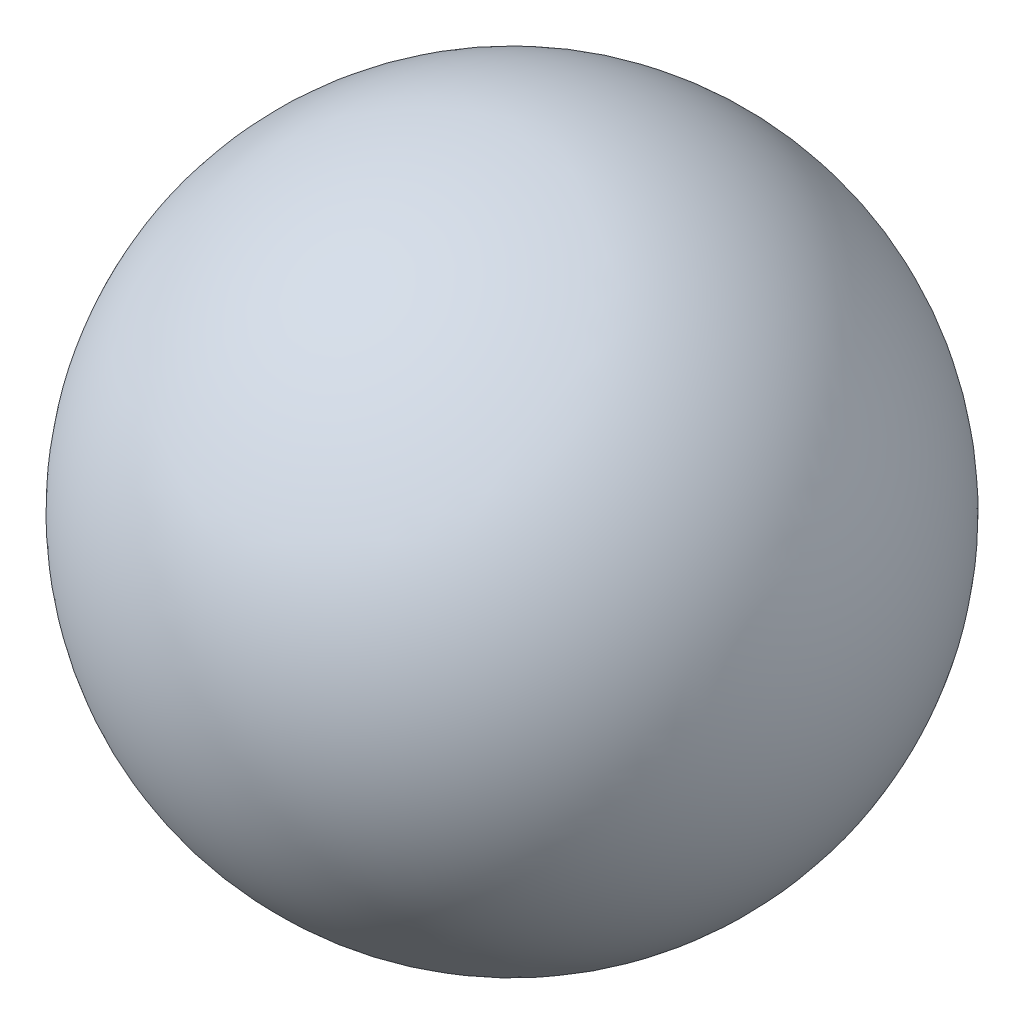
ISO-10303-21;
HEADER;
FILE_DESCRIPTION(('STEP AP214'),'2;1');
FILE_NAME('part.step','',(''),(''),'','','');
FILE_SCHEMA(('AUTOMOTIVE_DESIGN { 1 0 10303 214 1 1 1 1 }'));
ENDSEC;
DATA;
#1=APPLICATION_CONTEXT('core data for automotive mechanical design processes');
#2=APPLICATION_PROTOCOL_DEFINITION('international standard','automotive_design',2000,#1);
#3=PRODUCT_CONTEXT('',#1,'mechanical');
#4=PRODUCT('Part','Part','',(#3));
#5=PRODUCT_RELATED_PRODUCT_CATEGORY('part','',(#4));
#6=PRODUCT_DEFINITION_FORMATION('','',#4);
#7=PRODUCT_DEFINITION_CONTEXT('part definition',#1,'design');
#8=PRODUCT_DEFINITION('design','',#6,#7);
#9=PRODUCT_DEFINITION_SHAPE('','',#8);
#10=(LENGTH_UNIT() NAMED_UNIT(*) SI_UNIT(.MILLI.,.METRE.));
#11=(NAMED_UNIT(*) PLANE_ANGLE_UNIT() SI_UNIT($,.RADIAN.));
#12=(NAMED_UNIT(*) SI_UNIT($,.STERADIAN.) SOLID_ANGLE_UNIT());
#13=UNCERTAINTY_MEASURE_WITH_UNIT(LENGTH_MEASURE(1.E-05),#10,'distance_accuracy_value','');
#14=(GEOMETRIC_REPRESENTATION_CONTEXT(3) GLOBAL_UNCERTAINTY_ASSIGNED_CONTEXT((#13)) GLOBAL_UNIT_ASSIGNED_CONTEXT((#10,
#11,#12)) REPRESENTATION_CONTEXT('',''));
#15=CARTESIAN_POINT('',(0.,0.,0.));
#16=DIRECTION('',(0.,0.,1.));
#17=DIRECTION('',(1.,0.,0.));
#18=AXIS2_PLACEMENT_3D('',#15,#16,#17);
#19=CARTESIAN_POINT('',(0.,0.,0.));
#20=DIRECTION('',(-1.,0.,0.));
#21=DIRECTION('',(0.,0.,-1.));
#22=AXIS2_PLACEMENT_3D('',#19,#20,#21);
#23=SPHERICAL_SURFACE('',#22,8.);
#24=CARTESIAN_POINT('',(-8.,0.,0.));
#25=VERTEX_POINT('',#24);
#26=VERTEX_LOOP('',#25);
#27=FACE_BOUND('',#26,.T.);
#28=ADVANCED_FACE('F35',(#27),#23,.T.);
#29=CLOSED_SHELL('',(#28));
#30=MANIFOLD_SOLID_BREP('B2',#29);
#31=ADVANCED_BREP_SHAPE_REPRESENTATION('',(#18,#30),#14);
#32=SHAPE_DEFINITION_REPRESENTATION(#9,#31);
ENDSEC;
END-ISO-10303-21;
